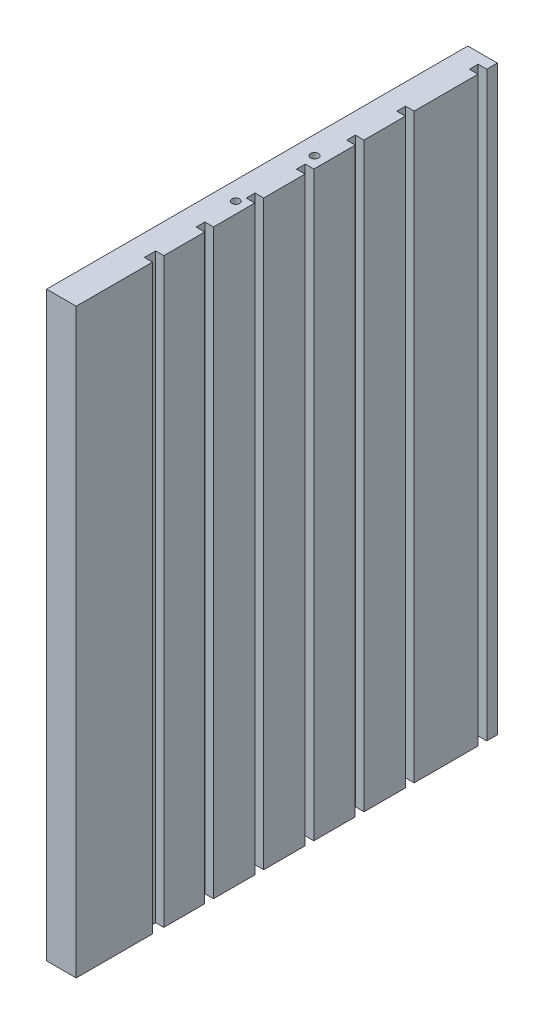
ISO-10303-21;
HEADER;
FILE_DESCRIPTION(('STEP AP214'),'2;1');
FILE_NAME('part.step','',(''),(''),'','','');
FILE_SCHEMA(('AUTOMOTIVE_DESIGN { 1 0 10303 214 1 1 1 1 }'));
ENDSEC;
DATA;
#1=APPLICATION_CONTEXT('core data for automotive mechanical design processes');
#2=APPLICATION_PROTOCOL_DEFINITION('international standard','automotive_design',2000,#1);
#3=PRODUCT_CONTEXT('',#1,'mechanical');
#4=PRODUCT('Part','Part','',(#3));
#5=PRODUCT_RELATED_PRODUCT_CATEGORY('part','',(#4));
#6=PRODUCT_DEFINITION_FORMATION('','',#4);
#7=PRODUCT_DEFINITION_CONTEXT('part definition',#1,'design');
#8=PRODUCT_DEFINITION('design','',#6,#7);
#9=PRODUCT_DEFINITION_SHAPE('','',#8);
#10=(LENGTH_UNIT() NAMED_UNIT(*) SI_UNIT(.MILLI.,.METRE.));
#11=(NAMED_UNIT(*) PLANE_ANGLE_UNIT() SI_UNIT($,.RADIAN.));
#12=(NAMED_UNIT(*) SI_UNIT($,.STERADIAN.) SOLID_ANGLE_UNIT());
#13=UNCERTAINTY_MEASURE_WITH_UNIT(LENGTH_MEASURE(1.E-05),#10,'distance_accuracy_value','');
#14=(GEOMETRIC_REPRESENTATION_CONTEXT(3) GLOBAL_UNCERTAINTY_ASSIGNED_CONTEXT((#13)) GLOBAL_UNIT_ASSIGNED_CONTEXT((#10,
#11,#12)) REPRESENTATION_CONTEXT('',''));
#15=CARTESIAN_POINT('',(0.,0.,0.));
#16=DIRECTION('',(0.,0.,1.));
#17=DIRECTION('',(1.,0.,0.));
#18=AXIS2_PLACEMENT_3D('',#15,#16,#17);
#19=CARTESIAN_POINT('',(109.3,58.5000000003788,8.56666666666666));
#20=DIRECTION('',(0.,1.,0.));
#21=DIRECTION('',(-1.,0.,0.));
#22=AXIS2_PLACEMENT_3D('',#19,#20,#21);
#23=CONICAL_SURFACE('',#22,0.839499999557179,1.02974425720102);
#24=CARTESIAN_POINT('',(109.3,57.99557750953,8.56666666675193));
#25=VERTEX_POINT('',#24);
#26=VERTEX_LOOP('',#25);
#27=FACE_BOUND('',#26,.T.);
#28=CARTESIAN_POINT('',(109.3,58.5000000000001,8.56666666666666));
#29=DIRECTION('',(0.,-1.,0.));
#30=DIRECTION('',(1.,0.,0.));
#31=AXIS2_PLACEMENT_3D('',#28,#29,#30);
#32=CIRCLE('',#31,0.8395);
#33=CARTESIAN_POINT('',(110.1395,58.5000000000001,8.56666666666666));
#34=VERTEX_POINT('',#33);
#35=EDGE_CURVE('E234',#34,#34,#32,.F.);
#36=ORIENTED_EDGE('',*,*,#35,.T.);
#37=EDGE_LOOP('',(#36));
#38=FACE_BOUND('',#37,.T.);
#39=ADVANCED_FACE('F17',(#27,#38),#23,.F.);
#40=CARTESIAN_POINT('',(109.3,58.5000000004356,-8.36666666666666));
#41=DIRECTION('',(0.,1.,0.));
#42=DIRECTION('',(-1.,0.,0.));
#43=AXIS2_PLACEMENT_3D('',#40,#41,#42);
#44=CONICAL_SURFACE('',#43,0.839499999550884,1.02974425714465);
#45=CARTESIAN_POINT('',(109.3,57.99557750953,-8.36666666658139));
#46=VERTEX_POINT('',#45);
#47=VERTEX_LOOP('',#46);
#48=FACE_BOUND('',#47,.T.);
#49=CARTESIAN_POINT('',(109.3,58.5000000000001,-8.36666666666666));
#50=DIRECTION('',(0.,-1.,0.));
#51=DIRECTION('',(1.,0.,0.));
#52=AXIS2_PLACEMENT_3D('',#49,#50,#51);
#53=CIRCLE('',#52,0.8395);
#54=CARTESIAN_POINT('',(110.1395,58.5000000000001,-8.36666666666666));
#55=VERTEX_POINT('',#54);
#56=EDGE_CURVE('E236',#55,#55,#53,.F.);
#57=ORIENTED_EDGE('',*,*,#56,.T.);
#58=EDGE_LOOP('',(#57));
#59=FACE_BOUND('',#58,.T.);
#60=ADVANCED_FACE('F231',(#48,#59),#44,.F.);
#61=CARTESIAN_POINT('',(111.700000000004,-62.4999999999998,-25.49));
#62=DIRECTION('',(0.,0.,1.));
#63=DIRECTION('',(1.,0.,0.));
#64=AXIS2_PLACEMENT_3D('',#61,#62,#63);
#65=PLANE('',#64);
#66=DIRECTION('',(0.,1.,0.));
#67=VECTOR('',#66,1.);
#68=CARTESIAN_POINT('',(111.7,62.5000000000002,-25.49));
#69=LINE('',#68,#67);
#70=CARTESIAN_POINT('',(111.700000000002,-62.4999999999998,-25.49));
#71=VERTEX_POINT('',#70);
#72=CARTESIAN_POINT('',(111.700000000002,62.5000000000002,-25.49));
#73=VERTEX_POINT('',#72);
#74=EDGE_CURVE('E243',#71,#73,#69,.T.);
#75=ORIENTED_EDGE('',*,*,#74,.F.);
#76=DIRECTION('',(1.,0.,0.));
#77=VECTOR('',#76,1.);
#78=CARTESIAN_POINT('',(109.700000000004,-62.4999999999999,-25.49));
#79=LINE('',#78,#77);
#80=CARTESIAN_POINT('',(109.850000000003,-62.4999999999999,-25.49));
#81=VERTEX_POINT('',#80);
#82=EDGE_CURVE('E356',#71,#81,#79,.F.);
#83=ORIENTED_EDGE('',*,*,#82,.T.);
#84=DIRECTION('',(0.,1.,0.));
#85=VECTOR('',#84,1.);
#86=CARTESIAN_POINT('',(109.850000000004,-62.4999999999999,-25.49));
#87=LINE('',#86,#85);
#88=CARTESIAN_POINT('',(109.850000000001,62.5000000000002,-25.49));
#89=VERTEX_POINT('',#88);
#90=EDGE_CURVE('E477',#81,#89,#87,.T.);
#91=ORIENTED_EDGE('',*,*,#90,.T.);
#92=DIRECTION('',(1.,0.,0.));
#93=VECTOR('',#92,1.);
#94=CARTESIAN_POINT('',(109.7,62.5000000000001,-25.49));
#95=LINE('',#94,#93);
#96=EDGE_CURVE('E350',#73,#89,#95,.F.);
#97=ORIENTED_EDGE('',*,*,#96,.F.);
#98=EDGE_LOOP('',(#75,#83,#91,#97));
#99=FACE_BOUND('',#98,.T.);
#100=ADVANCED_FACE('F480',(#99),#65,.F.);
#101=CARTESIAN_POINT('',(109.850000000004,-62.4999999999999,-25.49));
#102=DIRECTION('',(-1.,0.,0.));
#103=DIRECTION('',(0.,0.,1.));
#104=AXIS2_PLACEMENT_3D('',#101,#102,#103);
#105=PLANE('',#104);
#106=ORIENTED_EDGE('',*,*,#90,.F.);
#107=DIRECTION('',(0.,0.,1.));
#108=VECTOR('',#107,1.);
#109=CARTESIAN_POINT('',(109.850000000004,-62.4999999999999,0.));
#110=LINE('',#109,#108);
#111=CARTESIAN_POINT('',(109.850000000004,-62.4999999999999,-27.37));
#112=VERTEX_POINT('',#111);
#113=EDGE_CURVE('E416',#81,#112,#110,.F.);
#114=ORIENTED_EDGE('',*,*,#113,.T.);
#115=DIRECTION('',(0.,1.,0.));
#116=VECTOR('',#115,1.);
#117=CARTESIAN_POINT('',(109.850000000004,-62.4999999999999,-27.37));
#118=LINE('',#117,#116);
#119=CARTESIAN_POINT('',(109.850000000003,62.5000000000001,-27.37));
#120=VERTEX_POINT('',#119);
#121=EDGE_CURVE('E476',#112,#120,#118,.T.);
#122=ORIENTED_EDGE('',*,*,#121,.T.);
#123=DIRECTION('',(0.,0.,1.));
#124=VECTOR('',#123,1.);
#125=CARTESIAN_POINT('',(109.85,62.5000000000001,0.));
#126=LINE('',#125,#124);
#127=EDGE_CURVE('E347',#89,#120,#126,.F.);
#128=ORIENTED_EDGE('',*,*,#127,.F.);
#129=EDGE_LOOP('',(#106,#114,#122,#128));
#130=FACE_BOUND('',#129,.T.);
#131=ADVANCED_FACE('F484',(#130),#105,.F.);
#132=CARTESIAN_POINT('',(109.850000000004,-62.4999999999999,-27.37));
#133=DIRECTION('',(0.,0.,-1.));
#134=DIRECTION('',(-1.,0.,0.));
#135=AXIS2_PLACEMENT_3D('',#132,#133,#134);
#136=PLANE('',#135);
#137=ORIENTED_EDGE('',*,*,#121,.F.);
#138=DIRECTION('',(1.,0.,0.));
#139=VECTOR('',#138,1.);
#140=CARTESIAN_POINT('',(109.700000000004,-62.4999999999999,-27.37));
#141=LINE('',#140,#139);
#142=CARTESIAN_POINT('',(111.700000000001,-62.4999999999998,-27.37));
#143=VERTEX_POINT('',#142);
#144=EDGE_CURVE('E414',#112,#143,#141,.T.);
#145=ORIENTED_EDGE('',*,*,#144,.T.);
#146=DIRECTION('',(0.,1.,0.));
#147=VECTOR('',#146,1.);
#148=CARTESIAN_POINT('',(111.7,62.5000000000002,-27.37));
#149=LINE('',#148,#147);
#150=CARTESIAN_POINT('',(111.7,62.5000000000001,-27.37));
#151=VERTEX_POINT('',#150);
#152=EDGE_CURVE('E473',#151,#143,#149,.F.);
#153=ORIENTED_EDGE('',*,*,#152,.F.);
#154=DIRECTION('',(1.,0.,0.));
#155=VECTOR('',#154,1.);
#156=CARTESIAN_POINT('',(109.7,62.5000000000001,-27.37));
#157=LINE('',#156,#155);
#158=EDGE_CURVE('E344',#120,#151,#157,.T.);
#159=ORIENTED_EDGE('',*,*,#158,.F.);
#160=EDGE_LOOP('',(#137,#145,#153,#159));
#161=FACE_BOUND('',#160,.T.);
#162=ADVANCED_FACE('F621',(#161),#136,.F.);
#163=CARTESIAN_POINT('',(111.7,62.5000000000002,42.65));
#164=DIRECTION('',(1.,0.,0.));
#165=DIRECTION('',(0.,0.,-1.));
#166=AXIS2_PLACEMENT_3D('',#163,#164,#165);
#167=PLANE('',#166);
#168=DIRECTION('',(0.,1.,0.));
#169=VECTOR('',#168,1.);
#170=CARTESIAN_POINT('',(111.700000000004,-62.4999999999998,-41.09));
#171=LINE('',#170,#169);
#172=CARTESIAN_POINT('',(111.700000000002,-62.4999999999998,-41.09));
#173=VERTEX_POINT('',#172);
#174=CARTESIAN_POINT('',(111.700000000001,62.5000000000002,-41.09));
#175=VERTEX_POINT('',#174);
#176=EDGE_CURVE('E471',#173,#175,#171,.T.);
#177=ORIENTED_EDGE('',*,*,#176,.T.);
#178=DIRECTION('',(0.,0.,1.));
#179=VECTOR('',#178,1.);
#180=CARTESIAN_POINT('',(111.7,62.5000000000001,0.));
#181=LINE('',#180,#179);
#182=EDGE_CURVE('E341',#151,#175,#181,.F.);
#183=ORIENTED_EDGE('',*,*,#182,.F.);
#184=ORIENTED_EDGE('',*,*,#152,.T.);
#185=DIRECTION('',(0.,0.,1.));
#186=VECTOR('',#185,1.);
#187=CARTESIAN_POINT('',(111.700000000004,-62.4999999999999,0.));
#188=LINE('',#187,#186);
#189=EDGE_CURVE('E412',#143,#173,#188,.F.);
#190=ORIENTED_EDGE('',*,*,#189,.T.);
#191=EDGE_LOOP('',(#177,#183,#184,#190));
#192=FACE_BOUND('',#191,.T.);
#193=ADVANCED_FACE('F617',(#192),#167,.T.);
#194=CARTESIAN_POINT('',(111.700000000004,-62.4999999999998,-41.09));
#195=DIRECTION('',(0.,0.,1.));
#196=DIRECTION('',(1.,0.,0.));
#197=AXIS2_PLACEMENT_3D('',#194,#195,#196);
#198=PLANE('',#197);
#199=ORIENTED_EDGE('',*,*,#176,.F.);
#200=DIRECTION('',(1.,0.,0.));
#201=VECTOR('',#200,1.);
#202=CARTESIAN_POINT('',(109.700000000004,-62.4999999999999,-41.09));
#203=LINE('',#202,#201);
#204=CARTESIAN_POINT('',(109.850000000002,-62.4999999999999,-41.09));
#205=VERTEX_POINT('',#204);
#206=EDGE_CURVE('E410',#173,#205,#203,.F.);
#207=ORIENTED_EDGE('',*,*,#206,.T.);
#208=DIRECTION('',(0.,1.,0.));
#209=VECTOR('',#208,1.);
#210=CARTESIAN_POINT('',(109.850000000004,-62.4999999999999,-41.09));
#211=LINE('',#210,#209);
#212=CARTESIAN_POINT('',(109.850000000001,62.5000000000002,-41.09));
#213=VERTEX_POINT('',#212);
#214=EDGE_CURVE('E469',#205,#213,#211,.T.);
#215=ORIENTED_EDGE('',*,*,#214,.T.);
#216=DIRECTION('',(1.,0.,0.));
#217=VECTOR('',#216,1.);
#218=CARTESIAN_POINT('',(109.7,62.5000000000001,-41.09));
#219=LINE('',#218,#217);
#220=EDGE_CURVE('E338',#175,#213,#219,.F.);
#221=ORIENTED_EDGE('',*,*,#220,.F.);
#222=EDGE_LOOP('',(#199,#207,#215,#221));
#223=FACE_BOUND('',#222,.T.);
#224=ADVANCED_FACE('F613',(#223),#198,.F.);
#225=CARTESIAN_POINT('',(109.850000000004,-62.4999999999999,-41.09));
#226=DIRECTION('',(-1.,0.,0.));
#227=DIRECTION('',(0.,0.,1.));
#228=AXIS2_PLACEMENT_3D('',#225,#226,#227);
#229=PLANE('',#228);
#230=ORIENTED_EDGE('',*,*,#214,.F.);
#231=DIRECTION('',(0.,0.,1.));
#232=VECTOR('',#231,1.);
#233=CARTESIAN_POINT('',(109.850000000004,-62.4999999999999,0.));
#234=LINE('',#233,#232);
#235=CARTESIAN_POINT('',(109.850000000004,-62.4999999999999,-42.97));
#236=VERTEX_POINT('',#235);
#237=EDGE_CURVE('E408',#205,#236,#234,.F.);
#238=ORIENTED_EDGE('',*,*,#237,.T.);
#239=DIRECTION('',(0.,1.,0.));
#240=VECTOR('',#239,1.);
#241=CARTESIAN_POINT('',(109.850000000004,-62.4999999999999,-42.97));
#242=LINE('',#241,#240);
#243=CARTESIAN_POINT('',(109.850000000003,62.5000000000001,-42.97));
#244=VERTEX_POINT('',#243);
#245=EDGE_CURVE('E467',#236,#244,#242,.T.);
#246=ORIENTED_EDGE('',*,*,#245,.T.);
#247=DIRECTION('',(0.,0.,1.));
#248=VECTOR('',#247,1.);
#249=CARTESIAN_POINT('',(109.85,62.5000000000001,0.));
#250=LINE('',#249,#248);
#251=EDGE_CURVE('E335',#213,#244,#250,.F.);
#252=ORIENTED_EDGE('',*,*,#251,.F.);
#253=EDGE_LOOP('',(#230,#238,#246,#252));
#254=FACE_BOUND('',#253,.T.);
#255=ADVANCED_FACE('F609',(#254),#229,.F.);
#256=CARTESIAN_POINT('',(109.850000000004,-62.4999999999999,-42.97));
#257=DIRECTION('',(0.,0.,-1.));
#258=DIRECTION('',(-1.,0.,0.));
#259=AXIS2_PLACEMENT_3D('',#256,#257,#258);
#260=PLANE('',#259);
#261=ORIENTED_EDGE('',*,*,#245,.F.);
#262=DIRECTION('',(1.,0.,0.));
#263=VECTOR('',#262,1.);
#264=CARTESIAN_POINT('',(109.700000000004,-62.4999999999999,-42.97));
#265=LINE('',#264,#263);
#266=CARTESIAN_POINT('',(111.700000000001,-62.4999999999998,-42.97));
#267=VERTEX_POINT('',#266);
#268=EDGE_CURVE('E406',#236,#267,#265,.T.);
#269=ORIENTED_EDGE('',*,*,#268,.T.);
#270=DIRECTION('',(0.,1.,0.));
#271=VECTOR('',#270,1.);
#272=CARTESIAN_POINT('',(111.7,62.5000000000002,-42.97));
#273=LINE('',#272,#271);
#274=CARTESIAN_POINT('',(111.7,62.5000000000001,-42.97));
#275=VERTEX_POINT('',#274);
#276=EDGE_CURVE('E464',#275,#267,#273,.F.);
#277=ORIENTED_EDGE('',*,*,#276,.F.);
#278=DIRECTION('',(1.,0.,0.));
#279=VECTOR('',#278,1.);
#280=CARTESIAN_POINT('',(109.7,62.5000000000001,-42.97));
#281=LINE('',#280,#279);
#282=EDGE_CURVE('E332',#244,#275,#281,.T.);
#283=ORIENTED_EDGE('',*,*,#282,.F.);
#284=EDGE_LOOP('',(#261,#269,#277,#283));
#285=FACE_BOUND('',#284,.T.);
#286=ADVANCED_FACE('F605',(#285),#260,.F.);
#287=CARTESIAN_POINT('',(111.7,62.5000000000002,42.65));
#288=DIRECTION('',(1.,0.,0.));
#289=DIRECTION('',(0.,0.,-1.));
#290=AXIS2_PLACEMENT_3D('',#287,#288,#289);
#291=PLANE('',#290);
#292=DIRECTION('',(0.,1.,0.));
#293=VECTOR('',#292,1.);
#294=CARTESIAN_POINT('',(111.7,1.135082E-13,-45.24));
#295=LINE('',#294,#293);
#296=CARTESIAN_POINT('',(111.7,62.5000000000001,-45.24));
#297=VERTEX_POINT('',#296);
#298=CARTESIAN_POINT('',(111.700000000001,-62.4999999999998,-45.24));
#299=VERTEX_POINT('',#298);
#300=EDGE_CURVE('E240',#297,#299,#295,.F.);
#301=ORIENTED_EDGE('',*,*,#300,.F.);
#302=DIRECTION('',(0.,0.,1.));
#303=VECTOR('',#302,1.);
#304=CARTESIAN_POINT('',(111.7,62.5000000000001,0.));
#305=LINE('',#304,#303);
#306=EDGE_CURVE('E329',#275,#297,#305,.F.);
#307=ORIENTED_EDGE('',*,*,#306,.F.);
#308=ORIENTED_EDGE('',*,*,#276,.T.);
#309=DIRECTION('',(0.,0.,1.));
#310=VECTOR('',#309,1.);
#311=CARTESIAN_POINT('',(111.700000000004,-62.4999999999999,0.));
#312=LINE('',#311,#310);
#313=EDGE_CURVE('E404',#267,#299,#312,.F.);
#314=ORIENTED_EDGE('',*,*,#313,.T.);
#315=EDGE_LOOP('',(#301,#307,#308,#314));
#316=FACE_BOUND('',#315,.T.);
#317=ADVANCED_FACE('F601',(#316),#291,.T.);
#318=CARTESIAN_POINT('',(111.7,62.5000000000002,42.65));
#319=DIRECTION('',(1.,0.,0.));
#320=DIRECTION('',(0.,0.,-1.));
#321=AXIS2_PLACEMENT_3D('',#318,#319,#320);
#322=PLANE('',#321);
#323=DIRECTION('',(0.,1.,0.));
#324=VECTOR('',#323,1.);
#325=CARTESIAN_POINT('',(111.7,1.141744E-13,45.24));
#326=LINE('',#325,#324);
#327=CARTESIAN_POINT('',(111.7,62.5000000000001,45.24));
#328=VERTEX_POINT('',#327);
#329=CARTESIAN_POINT('',(111.700000000001,-62.4999999999998,45.24));
#330=VERTEX_POINT('',#329);
#331=EDGE_CURVE('E354',#328,#330,#326,.F.);
#332=ORIENTED_EDGE('',*,*,#331,.T.);
#333=DIRECTION('',(0.,0.,1.));
#334=VECTOR('',#333,1.);
#335=CARTESIAN_POINT('',(111.700000000004,-62.4999999999999,0.));
#336=LINE('',#335,#334);
#337=CARTESIAN_POINT('',(111.700000000002,-62.4999999999998,28.837));
#338=VERTEX_POINT('',#337);
#339=EDGE_CURVE('E400',#330,#338,#336,.F.);
#340=ORIENTED_EDGE('',*,*,#339,.T.);
#341=DIRECTION('',(0.,1.,0.));
#342=VECTOR('',#341,1.);
#343=CARTESIAN_POINT('',(111.700000000004,-62.4999999999998,28.837));
#344=LINE('',#343,#342);
#345=CARTESIAN_POINT('',(111.700000000001,62.5000000000002,28.837));
#346=VERTEX_POINT('',#345);
#347=EDGE_CURVE('E462',#338,#346,#344,.T.);
#348=ORIENTED_EDGE('',*,*,#347,.T.);
#349=DIRECTION('',(0.,0.,1.));
#350=VECTOR('',#349,1.);
#351=CARTESIAN_POINT('',(111.7,62.5000000000001,0.));
#352=LINE('',#351,#350);
#353=EDGE_CURVE('E322',#328,#346,#352,.F.);
#354=ORIENTED_EDGE('',*,*,#353,.F.);
#355=EDGE_LOOP('',(#332,#340,#348,#354));
#356=FACE_BOUND('',#355,.T.);
#357=ADVANCED_FACE('F597',(#356),#322,.T.);
#358=CARTESIAN_POINT('',(111.700000000004,-62.4999999999998,28.837));
#359=DIRECTION('',(0.,0.,1.));
#360=DIRECTION('',(1.,0.,0.));
#361=AXIS2_PLACEMENT_3D('',#358,#359,#360);
#362=PLANE('',#361);
#363=ORIENTED_EDGE('',*,*,#347,.F.);
#364=DIRECTION('',(1.,0.,0.));
#365=VECTOR('',#364,1.);
#366=CARTESIAN_POINT('',(109.700000000004,-62.4999999999999,28.837));
#367=LINE('',#366,#365);
#368=CARTESIAN_POINT('',(109.950000000002,-62.4999999999999,28.837));
#369=VERTEX_POINT('',#368);
#370=EDGE_CURVE('E398',#338,#369,#367,.F.);
#371=ORIENTED_EDGE('',*,*,#370,.T.);
#372=DIRECTION('',(0.,1.,0.));
#373=VECTOR('',#372,1.);
#374=CARTESIAN_POINT('',(109.950000000004,-62.4999999999999,28.837));
#375=LINE('',#374,#373);
#376=CARTESIAN_POINT('',(109.950000000001,62.5000000000002,28.837));
#377=VERTEX_POINT('',#376);
#378=EDGE_CURVE('E460',#369,#377,#375,.T.);
#379=ORIENTED_EDGE('',*,*,#378,.T.);
#380=DIRECTION('',(1.,0.,0.));
#381=VECTOR('',#380,1.);
#382=CARTESIAN_POINT('',(109.7,62.5000000000001,28.837));
#383=LINE('',#382,#381);
#384=EDGE_CURVE('E319',#346,#377,#383,.F.);
#385=ORIENTED_EDGE('',*,*,#384,.F.);
#386=EDGE_LOOP('',(#363,#371,#379,#385));
#387=FACE_BOUND('',#386,.T.);
#388=ADVANCED_FACE('F593',(#387),#362,.F.);
#389=CARTESIAN_POINT('',(109.950000000004,-62.4999999999999,28.837));
#390=DIRECTION('',(-1.,0.,0.));
#391=DIRECTION('',(0.,0.,1.));
#392=AXIS2_PLACEMENT_3D('',#389,#390,#391);
#393=PLANE('',#392);
#394=ORIENTED_EDGE('',*,*,#378,.F.);
#395=DIRECTION('',(0.,0.,1.));
#396=VECTOR('',#395,1.);
#397=CARTESIAN_POINT('',(109.950000000004,-62.4999999999999,0.));
#398=LINE('',#397,#396);
#399=CARTESIAN_POINT('',(109.950000000004,-62.4999999999999,26.423));
#400=VERTEX_POINT('',#399);
#401=EDGE_CURVE('E396',#369,#400,#398,.F.);
#402=ORIENTED_EDGE('',*,*,#401,.T.);
#403=DIRECTION('',(0.,1.,0.));
#404=VECTOR('',#403,1.);
#405=CARTESIAN_POINT('',(109.950000000004,-62.4999999999999,26.423));
#406=LINE('',#405,#404);
#407=CARTESIAN_POINT('',(109.950000000003,62.5000000000001,26.423));
#408=VERTEX_POINT('',#407);
#409=EDGE_CURVE('E458',#400,#408,#406,.T.);
#410=ORIENTED_EDGE('',*,*,#409,.T.);
#411=DIRECTION('',(0.,0.,1.));
#412=VECTOR('',#411,1.);
#413=CARTESIAN_POINT('',(109.95,62.5000000000001,0.));
#414=LINE('',#413,#412);
#415=EDGE_CURVE('E316',#377,#408,#414,.F.);
#416=ORIENTED_EDGE('',*,*,#415,.F.);
#417=EDGE_LOOP('',(#394,#402,#410,#416));
#418=FACE_BOUND('',#417,.T.);
#419=ADVANCED_FACE('F589',(#418),#393,.F.);
#420=CARTESIAN_POINT('',(109.950000000004,-62.4999999999999,26.423));
#421=DIRECTION('',(0.,0.,-1.));
#422=DIRECTION('',(-1.,0.,0.));
#423=AXIS2_PLACEMENT_3D('',#420,#421,#422);
#424=PLANE('',#423);
#425=ORIENTED_EDGE('',*,*,#409,.F.);
#426=DIRECTION('',(1.,0.,0.));
#427=VECTOR('',#426,1.);
#428=CARTESIAN_POINT('',(109.700000000004,-62.4999999999999,26.423));
#429=LINE('',#428,#427);
#430=CARTESIAN_POINT('',(111.700000000001,-62.4999999999998,26.423));
#431=VERTEX_POINT('',#430);
#432=EDGE_CURVE('E394',#400,#431,#429,.T.);
#433=ORIENTED_EDGE('',*,*,#432,.T.);
#434=DIRECTION('',(0.,1.,0.));
#435=VECTOR('',#434,1.);
#436=CARTESIAN_POINT('',(111.7,62.5000000000002,26.423));
#437=LINE('',#436,#435);
#438=CARTESIAN_POINT('',(111.7,62.5000000000001,26.423));
#439=VERTEX_POINT('',#438);
#440=EDGE_CURVE('E455',#439,#431,#437,.F.);
#441=ORIENTED_EDGE('',*,*,#440,.F.);
#442=DIRECTION('',(1.,0.,0.));
#443=VECTOR('',#442,1.);
#444=CARTESIAN_POINT('',(109.7,62.5000000000001,26.423));
#445=LINE('',#444,#443);
#446=EDGE_CURVE('E313',#408,#439,#445,.T.);
#447=ORIENTED_EDGE('',*,*,#446,.F.);
#448=EDGE_LOOP('',(#425,#433,#441,#447));
#449=FACE_BOUND('',#448,.T.);
#450=ADVANCED_FACE('F585',(#449),#424,.F.);
#451=CARTESIAN_POINT('',(111.7,62.5000000000002,42.65));
#452=DIRECTION('',(1.,0.,0.));
#453=DIRECTION('',(0.,0.,-1.));
#454=AXIS2_PLACEMENT_3D('',#451,#452,#453);
#455=PLANE('',#454);
#456=ORIENTED_EDGE('',*,*,#440,.T.);
#457=DIRECTION('',(0.,0.,1.));
#458=VECTOR('',#457,1.);
#459=CARTESIAN_POINT('',(111.700000000004,-62.4999999999999,0.));
#460=LINE('',#459,#458);
#461=CARTESIAN_POINT('',(111.700000000002,-62.4999999999998,17.63));
#462=VERTEX_POINT('',#461);
#463=EDGE_CURVE('E392',#431,#462,#460,.F.);
#464=ORIENTED_EDGE('',*,*,#463,.T.);
#465=DIRECTION('',(0.,1.,0.));
#466=VECTOR('',#465,1.);
#467=CARTESIAN_POINT('',(111.700000000004,-62.4999999999998,17.63));
#468=LINE('',#467,#466);
#469=CARTESIAN_POINT('',(111.700000000001,62.5000000000002,17.63));
#470=VERTEX_POINT('',#469);
#471=EDGE_CURVE('E453',#462,#470,#468,.T.);
#472=ORIENTED_EDGE('',*,*,#471,.T.);
#473=DIRECTION('',(0.,0.,1.));
#474=VECTOR('',#473,1.);
#475=CARTESIAN_POINT('',(111.7,62.5000000000001,0.));
#476=LINE('',#475,#474);
#477=EDGE_CURVE('E310',#439,#470,#476,.F.);
#478=ORIENTED_EDGE('',*,*,#477,.F.);
#479=EDGE_LOOP('',(#456,#464,#472,#478));
#480=FACE_BOUND('',#479,.T.);
#481=ADVANCED_FACE('F581',(#480),#455,.T.);
#482=CARTESIAN_POINT('',(111.700000000004,-62.4999999999998,17.63));
#483=DIRECTION('',(0.,0.,1.));
#484=DIRECTION('',(1.,0.,0.));
#485=AXIS2_PLACEMENT_3D('',#482,#483,#484);
#486=PLANE('',#485);
#487=ORIENTED_EDGE('',*,*,#471,.F.);
#488=DIRECTION('',(1.,0.,0.));
#489=VECTOR('',#488,1.);
#490=CARTESIAN_POINT('',(109.700000000004,-62.4999999999999,17.63));
#491=LINE('',#490,#489);
#492=CARTESIAN_POINT('',(109.850000000002,-62.4999999999999,17.63));
#493=VERTEX_POINT('',#492);
#494=EDGE_CURVE('E390',#462,#493,#491,.F.);
#495=ORIENTED_EDGE('',*,*,#494,.T.);
#496=DIRECTION('',(0.,1.,0.));
#497=VECTOR('',#496,1.);
#498=CARTESIAN_POINT('',(109.850000000004,-62.4999999999999,17.63));
#499=LINE('',#498,#497);
#500=CARTESIAN_POINT('',(109.850000000001,62.5000000000002,17.63));
#501=VERTEX_POINT('',#500);
#502=EDGE_CURVE('E451',#493,#501,#499,.T.);
#503=ORIENTED_EDGE('',*,*,#502,.T.);
#504=DIRECTION('',(1.,0.,0.));
#505=VECTOR('',#504,1.);
#506=CARTESIAN_POINT('',(109.7,62.5000000000001,17.63));
#507=LINE('',#506,#505);
#508=EDGE_CURVE('E307',#470,#501,#507,.F.);
#509=ORIENTED_EDGE('',*,*,#508,.F.);
#510=EDGE_LOOP('',(#487,#495,#503,#509));
#511=FACE_BOUND('',#510,.T.);
#512=ADVANCED_FACE('F577',(#511),#486,.F.);
#513=CARTESIAN_POINT('',(109.850000000004,-62.4999999999999,17.63));
#514=DIRECTION('',(-1.,0.,0.));
#515=DIRECTION('',(0.,0.,1.));
#516=AXIS2_PLACEMENT_3D('',#513,#514,#515);
#517=PLANE('',#516);
#518=ORIENTED_EDGE('',*,*,#502,.F.);
#519=DIRECTION('',(0.,0.,1.));
#520=VECTOR('',#519,1.);
#521=CARTESIAN_POINT('',(109.850000000004,-62.4999999999999,0.));
#522=LINE('',#521,#520);
#523=CARTESIAN_POINT('',(109.850000000004,-62.4999999999999,15.75));
#524=VERTEX_POINT('',#523);
#525=EDGE_CURVE('E388',#493,#524,#522,.F.);
#526=ORIENTED_EDGE('',*,*,#525,.T.);
#527=DIRECTION('',(0.,1.,0.));
#528=VECTOR('',#527,1.);
#529=CARTESIAN_POINT('',(109.850000000004,-62.4999999999999,15.75));
#530=LINE('',#529,#528);
#531=CARTESIAN_POINT('',(109.850000000003,62.5000000000001,15.75));
#532=VERTEX_POINT('',#531);
#533=EDGE_CURVE('E449',#524,#532,#530,.T.);
#534=ORIENTED_EDGE('',*,*,#533,.T.);
#535=DIRECTION('',(0.,0.,1.));
#536=VECTOR('',#535,1.);
#537=CARTESIAN_POINT('',(109.85,62.5000000000001,0.));
#538=LINE('',#537,#536);
#539=EDGE_CURVE('E304',#501,#532,#538,.F.);
#540=ORIENTED_EDGE('',*,*,#539,.F.);
#541=EDGE_LOOP('',(#518,#526,#534,#540));
#542=FACE_BOUND('',#541,.T.);
#543=ADVANCED_FACE('F573',(#542),#517,.F.);
#544=CARTESIAN_POINT('',(109.850000000004,-62.4999999999999,15.75));
#545=DIRECTION('',(0.,0.,-1.));
#546=DIRECTION('',(-1.,0.,0.));
#547=AXIS2_PLACEMENT_3D('',#544,#545,#546);
#548=PLANE('',#547);
#549=ORIENTED_EDGE('',*,*,#533,.F.);
#550=DIRECTION('',(1.,0.,0.));
#551=VECTOR('',#550,1.);
#552=CARTESIAN_POINT('',(109.700000000004,-62.4999999999999,15.75));
#553=LINE('',#552,#551);
#554=CARTESIAN_POINT('',(111.700000000001,-62.4999999999998,15.75));
#555=VERTEX_POINT('',#554);
#556=EDGE_CURVE('E386',#524,#555,#553,.T.);
#557=ORIENTED_EDGE('',*,*,#556,.T.);
#558=DIRECTION('',(0.,1.,0.));
#559=VECTOR('',#558,1.);
#560=CARTESIAN_POINT('',(111.7,62.5000000000002,15.75));
#561=LINE('',#560,#559);
#562=CARTESIAN_POINT('',(111.7,62.5000000000001,15.75));
#563=VERTEX_POINT('',#562);
#564=EDGE_CURVE('E446',#563,#555,#561,.F.);
#565=ORIENTED_EDGE('',*,*,#564,.F.);
#566=DIRECTION('',(1.,0.,0.));
#567=VECTOR('',#566,1.);
#568=CARTESIAN_POINT('',(109.7,62.5000000000001,15.75));
#569=LINE('',#568,#567);
#570=EDGE_CURVE('E301',#532,#563,#569,.T.);
#571=ORIENTED_EDGE('',*,*,#570,.F.);
#572=EDGE_LOOP('',(#549,#557,#565,#571));
#573=FACE_BOUND('',#572,.T.);
#574=ADVANCED_FACE('F569',(#573),#548,.F.);
#575=CARTESIAN_POINT('',(111.7,62.5000000000002,42.65));
#576=DIRECTION('',(1.,0.,0.));
#577=DIRECTION('',(0.,0.,-1.));
#578=AXIS2_PLACEMENT_3D('',#575,#576,#577);
#579=PLANE('',#578);
#580=DIRECTION('',(0.,1.,0.));
#581=VECTOR('',#580,1.);
#582=CARTESIAN_POINT('',(111.700000000004,-62.4999999999998,6.84999999999998));
#583=LINE('',#582,#581);
#584=CARTESIAN_POINT('',(111.700000000002,-62.4999999999998,6.84999999999998));
#585=VERTEX_POINT('',#584);
#586=CARTESIAN_POINT('',(111.700000000001,62.5000000000002,6.84999999999998));
#587=VERTEX_POINT('',#586);
#588=EDGE_CURVE('E444',#585,#587,#583,.T.);
#589=ORIENTED_EDGE('',*,*,#588,.T.);
#590=DIRECTION('',(0.,0.,1.));
#591=VECTOR('',#590,1.);
#592=CARTESIAN_POINT('',(111.7,62.5000000000001,0.));
#593=LINE('',#592,#591);
#594=EDGE_CURVE('E298',#563,#587,#593,.F.);
#595=ORIENTED_EDGE('',*,*,#594,.F.);
#596=ORIENTED_EDGE('',*,*,#564,.T.);
#597=DIRECTION('',(0.,0.,1.));
#598=VECTOR('',#597,1.);
#599=CARTESIAN_POINT('',(111.700000000004,-62.4999999999999,0.));
#600=LINE('',#599,#598);
#601=EDGE_CURVE('E384',#555,#585,#600,.F.);
#602=ORIENTED_EDGE('',*,*,#601,.T.);
#603=EDGE_LOOP('',(#589,#595,#596,#602));
#604=FACE_BOUND('',#603,.T.);
#605=ADVANCED_FACE('F565',(#604),#579,.T.);
#606=CARTESIAN_POINT('',(111.700000000004,-62.4999999999998,6.84999999999998));
#607=DIRECTION('',(0.,0.,1.));
#608=DIRECTION('',(1.,0.,0.));
#609=AXIS2_PLACEMENT_3D('',#606,#607,#608);
#610=PLANE('',#609);
#611=ORIENTED_EDGE('',*,*,#588,.F.);
#612=DIRECTION('',(1.,0.,0.));
#613=VECTOR('',#612,1.);
#614=CARTESIAN_POINT('',(109.700000000004,-62.4999999999999,6.84999999999998));
#615=LINE('',#614,#613);
#616=CARTESIAN_POINT('',(109.850000000002,-62.4999999999999,6.84999999999998));
#617=VERTEX_POINT('',#616);
#618=EDGE_CURVE('E382',#585,#617,#615,.F.);
#619=ORIENTED_EDGE('',*,*,#618,.T.);
#620=DIRECTION('',(0.,1.,0.));
#621=VECTOR('',#620,1.);
#622=CARTESIAN_POINT('',(109.850000000004,-62.4999999999999,6.84999999999998));
#623=LINE('',#622,#621);
#624=CARTESIAN_POINT('',(109.850000000001,62.5000000000002,6.84999999999998));
#625=VERTEX_POINT('',#624);
#626=EDGE_CURVE('E442',#617,#625,#623,.T.);
#627=ORIENTED_EDGE('',*,*,#626,.T.);
#628=DIRECTION('',(1.,0.,0.));
#629=VECTOR('',#628,1.);
#630=CARTESIAN_POINT('',(109.7,62.5000000000001,6.84999999999997));
#631=LINE('',#630,#629);
#632=EDGE_CURVE('E295',#587,#625,#631,.F.);
#633=ORIENTED_EDGE('',*,*,#632,.F.);
#634=EDGE_LOOP('',(#611,#619,#627,#633));
#635=FACE_BOUND('',#634,.T.);
#636=ADVANCED_FACE('F561',(#635),#610,.F.);
#637=CARTESIAN_POINT('',(109.850000000004,-62.4999999999999,6.84999999999998));
#638=DIRECTION('',(-1.,0.,0.));
#639=DIRECTION('',(0.,0.,1.));
#640=AXIS2_PLACEMENT_3D('',#637,#638,#639);
#641=PLANE('',#640);
#642=ORIENTED_EDGE('',*,*,#626,.F.);
#643=DIRECTION('',(0.,0.,1.));
#644=VECTOR('',#643,1.);
#645=CARTESIAN_POINT('',(109.850000000004,-62.4999999999999,0.));
#646=LINE('',#645,#644);
#647=CARTESIAN_POINT('',(109.850000000004,-62.4999999999999,4.96999999999998));
#648=VERTEX_POINT('',#647);
#649=EDGE_CURVE('E380',#617,#648,#646,.F.);
#650=ORIENTED_EDGE('',*,*,#649,.T.);
#651=DIRECTION('',(0.,1.,0.));
#652=VECTOR('',#651,1.);
#653=CARTESIAN_POINT('',(109.850000000004,-62.4999999999999,4.96999999999999));
#654=LINE('',#653,#652);
#655=CARTESIAN_POINT('',(109.850000000003,62.5000000000001,4.96999999999998));
#656=VERTEX_POINT('',#655);
#657=EDGE_CURVE('E440',#648,#656,#654,.T.);
#658=ORIENTED_EDGE('',*,*,#657,.T.);
#659=DIRECTION('',(0.,0.,1.));
#660=VECTOR('',#659,1.);
#661=CARTESIAN_POINT('',(109.85,62.5000000000001,0.));
#662=LINE('',#661,#660);
#663=EDGE_CURVE('E292',#625,#656,#662,.F.);
#664=ORIENTED_EDGE('',*,*,#663,.F.);
#665=EDGE_LOOP('',(#642,#650,#658,#664));
#666=FACE_BOUND('',#665,.T.);
#667=ADVANCED_FACE('F557',(#666),#641,.F.);
#668=CARTESIAN_POINT('',(109.850000000004,-62.4999999999999,4.96999999999999));
#669=DIRECTION('',(0.,0.,-1.));
#670=DIRECTION('',(-1.,0.,0.));
#671=AXIS2_PLACEMENT_3D('',#668,#669,#670);
#672=PLANE('',#671);
#673=ORIENTED_EDGE('',*,*,#657,.F.);
#674=DIRECTION('',(1.,0.,0.));
#675=VECTOR('',#674,1.);
#676=CARTESIAN_POINT('',(109.700000000004,-62.4999999999999,4.96999999999999));
#677=LINE('',#676,#675);
#678=CARTESIAN_POINT('',(111.700000000001,-62.4999999999998,4.96999999999999));
#679=VERTEX_POINT('',#678);
#680=EDGE_CURVE('E378',#648,#679,#677,.T.);
#681=ORIENTED_EDGE('',*,*,#680,.T.);
#682=DIRECTION('',(0.,1.,0.));
#683=VECTOR('',#682,1.);
#684=CARTESIAN_POINT('',(111.7,62.5000000000002,4.96999999999998));
#685=LINE('',#684,#683);
#686=CARTESIAN_POINT('',(111.7,62.5000000000001,4.96999999999998));
#687=VERTEX_POINT('',#686);
#688=EDGE_CURVE('E437',#687,#679,#685,.F.);
#689=ORIENTED_EDGE('',*,*,#688,.F.);
#690=DIRECTION('',(1.,0.,0.));
#691=VECTOR('',#690,1.);
#692=CARTESIAN_POINT('',(109.7,62.5000000000001,4.96999999999998));
#693=LINE('',#692,#691);
#694=EDGE_CURVE('E289',#656,#687,#693,.T.);
#695=ORIENTED_EDGE('',*,*,#694,.F.);
#696=EDGE_LOOP('',(#673,#681,#689,#695));
#697=FACE_BOUND('',#696,.T.);
#698=ADVANCED_FACE('F553',(#697),#672,.F.);
#699=CARTESIAN_POINT('',(111.7,62.5000000000002,42.65));
#700=DIRECTION('',(1.,0.,0.));
#701=DIRECTION('',(0.,0.,-1.));
#702=AXIS2_PLACEMENT_3D('',#699,#700,#701);
#703=PLANE('',#702);
#704=ORIENTED_EDGE('',*,*,#688,.T.);
#705=DIRECTION('',(0.,0.,1.));
#706=VECTOR('',#705,1.);
#707=CARTESIAN_POINT('',(111.700000000004,-62.4999999999999,0.));
#708=LINE('',#707,#706);
#709=CARTESIAN_POINT('',(111.700000000002,-62.4999999999998,-3.93000000000002));
#710=VERTEX_POINT('',#709);
#711=EDGE_CURVE('E376',#679,#710,#708,.F.);
#712=ORIENTED_EDGE('',*,*,#711,.T.);
#713=DIRECTION('',(0.,1.,0.));
#714=VECTOR('',#713,1.);
#715=CARTESIAN_POINT('',(111.700000000004,-62.4999999999998,-3.93000000000002));
#716=LINE('',#715,#714);
#717=CARTESIAN_POINT('',(111.700000000001,62.5000000000002,-3.93000000000002));
#718=VERTEX_POINT('',#717);
#719=EDGE_CURVE('E435',#710,#718,#716,.T.);
#720=ORIENTED_EDGE('',*,*,#719,.T.);
#721=DIRECTION('',(0.,0.,1.));
#722=VECTOR('',#721,1.);
#723=CARTESIAN_POINT('',(111.7,62.5000000000001,0.));
#724=LINE('',#723,#722);
#725=EDGE_CURVE('E286',#687,#718,#724,.F.);
#726=ORIENTED_EDGE('',*,*,#725,.F.);
#727=EDGE_LOOP('',(#704,#712,#720,#726));
#728=FACE_BOUND('',#727,.T.);
#729=ADVANCED_FACE('F549',(#728),#703,.T.);
#730=CARTESIAN_POINT('',(111.700000000004,-62.4999999999998,-3.93000000000002));
#731=DIRECTION('',(0.,0.,1.));
#732=DIRECTION('',(1.,0.,0.));
#733=AXIS2_PLACEMENT_3D('',#730,#731,#732);
#734=PLANE('',#733);
#735=ORIENTED_EDGE('',*,*,#719,.F.);
#736=DIRECTION('',(1.,0.,0.));
#737=VECTOR('',#736,1.);
#738=CARTESIAN_POINT('',(109.700000000004,-62.4999999999999,-3.93000000000002));
#739=LINE('',#738,#737);
#740=CARTESIAN_POINT('',(109.850000000002,-62.4999999999999,-3.93000000000002));
#741=VERTEX_POINT('',#740);
#742=EDGE_CURVE('E374',#710,#741,#739,.F.);
#743=ORIENTED_EDGE('',*,*,#742,.T.);
#744=DIRECTION('',(0.,1.,0.));
#745=VECTOR('',#744,1.);
#746=CARTESIAN_POINT('',(109.850000000004,-62.4999999999999,-3.93000000000002));
#747=LINE('',#746,#745);
#748=CARTESIAN_POINT('',(109.850000000001,62.5000000000002,-3.93000000000002));
#749=VERTEX_POINT('',#748);
#750=EDGE_CURVE('E433',#741,#749,#747,.T.);
#751=ORIENTED_EDGE('',*,*,#750,.T.);
#752=DIRECTION('',(1.,0.,0.));
#753=VECTOR('',#752,1.);
#754=CARTESIAN_POINT('',(109.7,62.5000000000001,-3.93000000000003));
#755=LINE('',#754,#753);
#756=EDGE_CURVE('E283',#718,#749,#755,.F.);
#757=ORIENTED_EDGE('',*,*,#756,.F.);
#758=EDGE_LOOP('',(#735,#743,#751,#757));
#759=FACE_BOUND('',#758,.T.);
#760=ADVANCED_FACE('F545',(#759),#734,.F.);
#761=CARTESIAN_POINT('',(109.850000000004,-62.4999999999999,-3.93000000000002));
#762=DIRECTION('',(-1.,0.,0.));
#763=DIRECTION('',(0.,0.,1.));
#764=AXIS2_PLACEMENT_3D('',#761,#762,#763);
#765=PLANE('',#764);
#766=ORIENTED_EDGE('',*,*,#750,.F.);
#767=DIRECTION('',(0.,0.,1.));
#768=VECTOR('',#767,1.);
#769=CARTESIAN_POINT('',(109.850000000004,-62.4999999999999,0.));
#770=LINE('',#769,#768);
#771=CARTESIAN_POINT('',(109.850000000004,-62.4999999999999,-5.81000000000002));
#772=VERTEX_POINT('',#771);
#773=EDGE_CURVE('E372',#741,#772,#770,.F.);
#774=ORIENTED_EDGE('',*,*,#773,.T.);
#775=DIRECTION('',(0.,1.,0.));
#776=VECTOR('',#775,1.);
#777=CARTESIAN_POINT('',(109.850000000004,-62.4999999999999,-5.81000000000001));
#778=LINE('',#777,#776);
#779=CARTESIAN_POINT('',(109.850000000003,62.5000000000001,-5.81000000000002));
#780=VERTEX_POINT('',#779);
#781=EDGE_CURVE('E431',#772,#780,#778,.T.);
#782=ORIENTED_EDGE('',*,*,#781,.T.);
#783=DIRECTION('',(0.,0.,1.));
#784=VECTOR('',#783,1.);
#785=CARTESIAN_POINT('',(109.85,62.5000000000001,0.));
#786=LINE('',#785,#784);
#787=EDGE_CURVE('E280',#749,#780,#786,.F.);
#788=ORIENTED_EDGE('',*,*,#787,.F.);
#789=EDGE_LOOP('',(#766,#774,#782,#788));
#790=FACE_BOUND('',#789,.T.);
#791=ADVANCED_FACE('F541',(#790),#765,.F.);
#792=CARTESIAN_POINT('',(109.850000000004,-62.4999999999999,-5.81000000000001));
#793=DIRECTION('',(0.,0.,-1.));
#794=DIRECTION('',(-1.,0.,0.));
#795=AXIS2_PLACEMENT_3D('',#792,#793,#794);
#796=PLANE('',#795);
#797=ORIENTED_EDGE('',*,*,#781,.F.);
#798=DIRECTION('',(1.,0.,0.));
#799=VECTOR('',#798,1.);
#800=CARTESIAN_POINT('',(109.700000000004,-62.4999999999999,-5.81000000000001));
#801=LINE('',#800,#799);
#802=CARTESIAN_POINT('',(111.700000000001,-62.4999999999998,-5.81000000000002));
#803=VERTEX_POINT('',#802);
#804=EDGE_CURVE('E370',#772,#803,#801,.T.);
#805=ORIENTED_EDGE('',*,*,#804,.T.);
#806=DIRECTION('',(0.,1.,0.));
#807=VECTOR('',#806,1.);
#808=CARTESIAN_POINT('',(111.7,62.5000000000002,-5.81000000000002));
#809=LINE('',#808,#807);
#810=CARTESIAN_POINT('',(111.7,62.5000000000001,-5.81000000000002));
#811=VERTEX_POINT('',#810);
#812=EDGE_CURVE('E428',#811,#803,#809,.F.);
#813=ORIENTED_EDGE('',*,*,#812,.F.);
#814=DIRECTION('',(1.,0.,0.));
#815=VECTOR('',#814,1.);
#816=CARTESIAN_POINT('',(109.7,62.5000000000001,-5.81000000000002));
#817=LINE('',#816,#815);
#818=EDGE_CURVE('E277',#780,#811,#817,.T.);
#819=ORIENTED_EDGE('',*,*,#818,.F.);
#820=EDGE_LOOP('',(#797,#805,#813,#819));
#821=FACE_BOUND('',#820,.T.);
#822=ADVANCED_FACE('F537',(#821),#796,.F.);
#823=CARTESIAN_POINT('',(111.7,62.5000000000002,42.65));
#824=DIRECTION('',(1.,0.,0.));
#825=DIRECTION('',(0.,0.,-1.));
#826=AXIS2_PLACEMENT_3D('',#823,#824,#825);
#827=PLANE('',#826);
#828=DIRECTION('',(0.,1.,0.));
#829=VECTOR('',#828,1.);
#830=CARTESIAN_POINT('',(111.700000000004,-62.4999999999998,-14.71));
#831=LINE('',#830,#829);
#832=CARTESIAN_POINT('',(111.700000000002,-62.4999999999998,-14.71));
#833=VERTEX_POINT('',#832);
#834=CARTESIAN_POINT('',(111.700000000001,62.5000000000002,-14.71));
#835=VERTEX_POINT('',#834);
#836=EDGE_CURVE('E426',#833,#835,#831,.T.);
#837=ORIENTED_EDGE('',*,*,#836,.T.);
#838=DIRECTION('',(0.,0.,1.));
#839=VECTOR('',#838,1.);
#840=CARTESIAN_POINT('',(111.7,62.5000000000001,0.));
#841=LINE('',#840,#839);
#842=EDGE_CURVE('E274',#811,#835,#841,.F.);
#843=ORIENTED_EDGE('',*,*,#842,.F.);
#844=ORIENTED_EDGE('',*,*,#812,.T.);
#845=DIRECTION('',(0.,0.,1.));
#846=VECTOR('',#845,1.);
#847=CARTESIAN_POINT('',(111.700000000004,-62.4999999999999,0.));
#848=LINE('',#847,#846);
#849=EDGE_CURVE('E368',#803,#833,#848,.F.);
#850=ORIENTED_EDGE('',*,*,#849,.T.);
#851=EDGE_LOOP('',(#837,#843,#844,#850));
#852=FACE_BOUND('',#851,.T.);
#853=ADVANCED_FACE('F533',(#852),#827,.T.);
#854=CARTESIAN_POINT('',(111.700000000004,-62.4999999999998,-14.71));
#855=DIRECTION('',(0.,0.,1.));
#856=DIRECTION('',(1.,0.,0.));
#857=AXIS2_PLACEMENT_3D('',#854,#855,#856);
#858=PLANE('',#857);
#859=ORIENTED_EDGE('',*,*,#836,.F.);
#860=DIRECTION('',(1.,0.,0.));
#861=VECTOR('',#860,1.);
#862=CARTESIAN_POINT('',(109.700000000004,-62.4999999999999,-14.71));
#863=LINE('',#862,#861);
#864=CARTESIAN_POINT('',(109.850000000002,-62.4999999999999,-14.71));
#865=VERTEX_POINT('',#864);
#866=EDGE_CURVE('E366',#833,#865,#863,.F.);
#867=ORIENTED_EDGE('',*,*,#866,.T.);
#868=DIRECTION('',(0.,1.,0.));
#869=VECTOR('',#868,1.);
#870=CARTESIAN_POINT('',(109.850000000004,-62.4999999999999,-14.71));
#871=LINE('',#870,#869);
#872=CARTESIAN_POINT('',(109.850000000001,62.5000000000002,-14.71));
#873=VERTEX_POINT('',#872);
#874=EDGE_CURVE('E424',#865,#873,#871,.T.);
#875=ORIENTED_EDGE('',*,*,#874,.T.);
#876=DIRECTION('',(1.,0.,0.));
#877=VECTOR('',#876,1.);
#878=CARTESIAN_POINT('',(109.7,62.5000000000001,-14.71));
#879=LINE('',#878,#877);
#880=EDGE_CURVE('E271',#835,#873,#879,.F.);
#881=ORIENTED_EDGE('',*,*,#880,.F.);
#882=EDGE_LOOP('',(#859,#867,#875,#881));
#883=FACE_BOUND('',#882,.T.);
#884=ADVANCED_FACE('F529',(#883),#858,.F.);
#885=CARTESIAN_POINT('',(109.850000000004,-62.4999999999999,-14.71));
#886=DIRECTION('',(-1.,0.,0.));
#887=DIRECTION('',(0.,0.,1.));
#888=AXIS2_PLACEMENT_3D('',#885,#886,#887);
#889=PLANE('',#888);
#890=ORIENTED_EDGE('',*,*,#874,.F.);
#891=DIRECTION('',(0.,0.,1.));
#892=VECTOR('',#891,1.);
#893=CARTESIAN_POINT('',(109.850000000004,-62.4999999999999,0.));
#894=LINE('',#893,#892);
#895=CARTESIAN_POINT('',(109.850000000004,-62.4999999999999,-16.59));
#896=VERTEX_POINT('',#895);
#897=EDGE_CURVE('E364',#865,#896,#894,.F.);
#898=ORIENTED_EDGE('',*,*,#897,.T.);
#899=DIRECTION('',(0.,1.,0.));
#900=VECTOR('',#899,1.);
#901=CARTESIAN_POINT('',(109.850000000004,-62.4999999999999,-16.59));
#902=LINE('',#901,#900);
#903=CARTESIAN_POINT('',(109.850000000003,62.5000000000001,-16.59));
#904=VERTEX_POINT('',#903);
#905=EDGE_CURVE('E422',#896,#904,#902,.T.);
#906=ORIENTED_EDGE('',*,*,#905,.T.);
#907=DIRECTION('',(0.,0.,1.));
#908=VECTOR('',#907,1.);
#909=CARTESIAN_POINT('',(109.85,62.5000000000001,0.));
#910=LINE('',#909,#908);
#911=EDGE_CURVE('E265',#873,#904,#910,.F.);
#912=ORIENTED_EDGE('',*,*,#911,.F.);
#913=EDGE_LOOP('',(#890,#898,#906,#912));
#914=FACE_BOUND('',#913,.T.);
#915=ADVANCED_FACE('F525',(#914),#889,.F.);
#916=CARTESIAN_POINT('',(109.850000000004,-62.4999999999999,-16.59));
#917=DIRECTION('',(0.,0.,-1.));
#918=DIRECTION('',(-1.,0.,0.));
#919=AXIS2_PLACEMENT_3D('',#916,#917,#918);
#920=PLANE('',#919);
#921=ORIENTED_EDGE('',*,*,#905,.F.);
#922=DIRECTION('',(1.,0.,0.));
#923=VECTOR('',#922,1.);
#924=CARTESIAN_POINT('',(109.700000000004,-62.4999999999999,-16.59));
#925=LINE('',#924,#923);
#926=CARTESIAN_POINT('',(111.700000000001,-62.4999999999998,-16.59));
#927=VERTEX_POINT('',#926);
#928=EDGE_CURVE('E362',#896,#927,#925,.T.);
#929=ORIENTED_EDGE('',*,*,#928,.T.);
#930=DIRECTION('',(0.,1.,0.));
#931=VECTOR('',#930,1.);
#932=CARTESIAN_POINT('',(111.7,62.5000000000002,-16.59));
#933=LINE('',#932,#931);
#934=CARTESIAN_POINT('',(111.7,62.5000000000001,-16.59));
#935=VERTEX_POINT('',#934);
#936=EDGE_CURVE('E237',#935,#927,#933,.F.);
#937=ORIENTED_EDGE('',*,*,#936,.F.);
#938=DIRECTION('',(1.,0.,0.));
#939=VECTOR('',#938,1.);
#940=CARTESIAN_POINT('',(109.7,62.5000000000001,-16.59));
#941=LINE('',#940,#939);
#942=EDGE_CURVE('E259',#904,#935,#941,.T.);
#943=ORIENTED_EDGE('',*,*,#942,.F.);
#944=EDGE_LOOP('',(#921,#929,#937,#943));
#945=FACE_BOUND('',#944,.T.);
#946=ADVANCED_FACE('F521',(#945),#920,.F.);
#947=CARTESIAN_POINT('',(111.7,62.5000000000002,42.65));
#948=DIRECTION('',(1.,0.,0.));
#949=DIRECTION('',(0.,0.,-1.));
#950=AXIS2_PLACEMENT_3D('',#947,#948,#949);
#951=PLANE('',#950);
#952=ORIENTED_EDGE('',*,*,#936,.T.);
#953=DIRECTION('',(0.,0.,1.));
#954=VECTOR('',#953,1.);
#955=CARTESIAN_POINT('',(111.700000000004,-62.4999999999999,0.));
#956=LINE('',#955,#954);
#957=EDGE_CURVE('E359',#927,#71,#956,.F.);
#958=ORIENTED_EDGE('',*,*,#957,.T.);
#959=ORIENTED_EDGE('',*,*,#74,.T.);
#960=DIRECTION('',(0.,0.,1.));
#961=VECTOR('',#960,1.);
#962=CARTESIAN_POINT('',(111.7,62.5000000000001,0.));
#963=LINE('',#962,#961);
#964=EDGE_CURVE('E255',#935,#73,#963,.F.);
#965=ORIENTED_EDGE('',*,*,#964,.F.);
#966=EDGE_LOOP('',(#952,#958,#959,#965));
#967=FACE_BOUND('',#966,.T.);
#968=ADVANCED_FACE('F517',(#967),#951,.T.);
#969=CARTESIAN_POINT('',(109.3,60.5000000000001,8.56666666666666));
#970=DIRECTION('',(0.,-1.,0.));
#971=DIRECTION('',(1.,0.,0.));
#972=AXIS2_PLACEMENT_3D('',#969,#970,#971);
#973=CYLINDRICAL_SURFACE('',#972,0.8395);
#974=CARTESIAN_POINT('',(109.3,62.5000000000001,8.56666666666666));
#975=DIRECTION('',(0.,-1.,0.));
#976=DIRECTION('',(1.,0.,0.));
#977=AXIS2_PLACEMENT_3D('',#974,#975,#976);
#978=CIRCLE('',#977,0.8395);
#979=CARTESIAN_POINT('',(110.1395,62.5000000000001,8.56666666666666));
#980=VERTEX_POINT('',#979);
#981=EDGE_CURVE('E20',#980,#980,#978,.T.);
#982=ORIENTED_EDGE('',*,*,#981,.F.);
#983=EDGE_LOOP('',(#982));
#984=FACE_BOUND('',#983,.T.);
#985=ORIENTED_EDGE('',*,*,#35,.F.);
#986=EDGE_LOOP('',(#985));
#987=FACE_BOUND('',#986,.T.);
#988=ADVANCED_FACE('F513',(#984,#987),#973,.F.);
#989=CARTESIAN_POINT('',(109.3,60.5000000000001,-8.36666666666666));
#990=DIRECTION('',(0.,-1.,0.));
#991=DIRECTION('',(1.,0.,0.));
#992=AXIS2_PLACEMENT_3D('',#989,#990,#991);
#993=CYLINDRICAL_SURFACE('',#992,0.8395);
#994=CARTESIAN_POINT('',(109.3,62.5000000000001,-8.36666666666666));
#995=DIRECTION('',(0.,-1.,0.));
#996=DIRECTION('',(1.,0.,0.));
#997=AXIS2_PLACEMENT_3D('',#994,#995,#996);
#998=CIRCLE('',#997,0.8395);
#999=CARTESIAN_POINT('',(110.1395,62.5000000000001,-8.36666666666666));
#1000=VERTEX_POINT('',#999);
#1001=EDGE_CURVE('E246',#1000,#1000,#998,.T.);
#1002=ORIENTED_EDGE('',*,*,#1001,.F.);
#1003=EDGE_LOOP('',(#1002));
#1004=FACE_BOUND('',#1003,.T.);
#1005=ORIENTED_EDGE('',*,*,#56,.F.);
#1006=EDGE_LOOP('',(#1005));
#1007=FACE_BOUND('',#1006,.T.);
#1008=ADVANCED_FACE('F509',(#1004,#1007),#993,.F.);
#1009=CARTESIAN_POINT('',(109.300000000002,1.135082E-13,-45.24));
#1010=DIRECTION('',(0.,0.,-1.));
#1011=DIRECTION('',(-1.,0.,0.));
#1012=AXIS2_PLACEMENT_3D('',#1009,#1010,#1011);
#1013=PLANE('',#1012);
#1014=DIRECTION('',(1.,0.,0.));
#1015=VECTOR('',#1014,1.);
#1016=CARTESIAN_POINT('',(109.7,62.5000000000001,-45.24));
#1017=LINE('',#1016,#1015);
#1018=CARTESIAN_POINT('',(105.350000000001,62.5,-45.24));
#1019=VERTEX_POINT('',#1018);
#1020=EDGE_CURVE('E326',#297,#1019,#1017,.F.);
#1021=ORIENTED_EDGE('',*,*,#1020,.F.);
#1022=ORIENTED_EDGE('',*,*,#300,.T.);
#1023=DIRECTION('',(1.,0.,0.));
#1024=VECTOR('',#1023,1.);
#1025=CARTESIAN_POINT('',(109.700000000004,-62.4999999999999,-45.24));
#1026=LINE('',#1025,#1024);
#1027=CARTESIAN_POINT('',(105.350000000002,-62.4999999999999,-45.24));
#1028=VERTEX_POINT('',#1027);
#1029=EDGE_CURVE('E402',#299,#1028,#1026,.F.);
#1030=ORIENTED_EDGE('',*,*,#1029,.T.);
#1031=DIRECTION('',(0.,1.,0.));
#1032=VECTOR('',#1031,1.);
#1033=CARTESIAN_POINT('',(105.350000000001,0.,-45.24));
#1034=LINE('',#1033,#1032);
#1035=EDGE_CURVE('E248',#1019,#1028,#1034,.F.);
#1036=ORIENTED_EDGE('',*,*,#1035,.F.);
#1037=EDGE_LOOP('',(#1021,#1022,#1030,#1036));
#1038=FACE_BOUND('',#1037,.T.);
#1039=ADVANCED_FACE('F505',(#1038),#1013,.T.);
#1040=CARTESIAN_POINT('',(109.700000000004,-62.4999999999999,0.));
#1041=DIRECTION('',(0.,1.,0.));
#1042=DIRECTION('',(0.,0.,1.));
#1043=AXIS2_PLACEMENT_3D('',#1040,#1041,#1042);
#1044=PLANE('',#1043);
#1045=ORIENTED_EDGE('',*,*,#957,.F.);
#1046=ORIENTED_EDGE('',*,*,#928,.F.);
#1047=ORIENTED_EDGE('',*,*,#897,.F.);
#1048=ORIENTED_EDGE('',*,*,#866,.F.);
#1049=ORIENTED_EDGE('',*,*,#849,.F.);
#1050=ORIENTED_EDGE('',*,*,#804,.F.);
#1051=ORIENTED_EDGE('',*,*,#773,.F.);
#1052=ORIENTED_EDGE('',*,*,#742,.F.);
#1053=ORIENTED_EDGE('',*,*,#711,.F.);
#1054=ORIENTED_EDGE('',*,*,#680,.F.);
#1055=ORIENTED_EDGE('',*,*,#649,.F.);
#1056=ORIENTED_EDGE('',*,*,#618,.F.);
#1057=ORIENTED_EDGE('',*,*,#601,.F.);
#1058=ORIENTED_EDGE('',*,*,#556,.F.);
#1059=ORIENTED_EDGE('',*,*,#525,.F.);
#1060=ORIENTED_EDGE('',*,*,#494,.F.);
#1061=ORIENTED_EDGE('',*,*,#463,.F.);
#1062=ORIENTED_EDGE('',*,*,#432,.F.);
#1063=ORIENTED_EDGE('',*,*,#401,.F.);
#1064=ORIENTED_EDGE('',*,*,#370,.F.);
#1065=ORIENTED_EDGE('',*,*,#339,.F.);
#1066=DIRECTION('',(-1.,0.,0.));
#1067=VECTOR('',#1066,1.);
#1068=CARTESIAN_POINT('',(109.300000000002,-62.4999999999998,45.24));
#1069=LINE('',#1068,#1067);
#1070=CARTESIAN_POINT('',(105.350000000002,-62.4999999999999,45.24));
#1071=VERTEX_POINT('',#1070);
#1072=EDGE_CURVE('E352',#330,#1071,#1069,.T.);
#1073=ORIENTED_EDGE('',*,*,#1072,.T.);
#1074=DIRECTION('',(0.,0.,1.));
#1075=VECTOR('',#1074,1.);
#1076=CARTESIAN_POINT('',(105.350000000001,-62.5,0.));
#1077=LINE('',#1076,#1075);
#1078=EDGE_CURVE('E252',#1028,#1071,#1077,.T.);
#1079=ORIENTED_EDGE('',*,*,#1078,.F.);
#1080=ORIENTED_EDGE('',*,*,#1029,.F.);
#1081=ORIENTED_EDGE('',*,*,#313,.F.);
#1082=ORIENTED_EDGE('',*,*,#268,.F.);
#1083=ORIENTED_EDGE('',*,*,#237,.F.);
#1084=ORIENTED_EDGE('',*,*,#206,.F.);
#1085=ORIENTED_EDGE('',*,*,#189,.F.);
#1086=ORIENTED_EDGE('',*,*,#144,.F.);
#1087=ORIENTED_EDGE('',*,*,#113,.F.);
#1088=ORIENTED_EDGE('',*,*,#82,.F.);
#1089=EDGE_LOOP('',(#1045,#1046,#1047,#1048,#1049,#1050,#1051,#1052,#1053,#1054,#1055,#1056,
#1057,#1058,#1059,#1060,#1061,#1062,#1063,#1064,#1065,#1073,#1079,#1080,#1081,#1082,#1083,#1084,
#1085,#1086,#1087,#1088));
#1090=FACE_BOUND('',#1089,.T.);
#1091=ADVANCED_FACE('F500',(#1090),#1044,.F.);
#1092=CARTESIAN_POINT('',(109.300000000002,1.141744E-13,45.24));
#1093=DIRECTION('',(0.,0.,-1.));
#1094=DIRECTION('',(-1.,0.,0.));
#1095=AXIS2_PLACEMENT_3D('',#1092,#1093,#1094);
#1096=PLANE('',#1095);
#1097=ORIENTED_EDGE('',*,*,#331,.F.);
#1098=DIRECTION('',(1.,0.,0.));
#1099=VECTOR('',#1098,1.);
#1100=CARTESIAN_POINT('',(109.7,62.5000000000001,45.24));
#1101=LINE('',#1100,#1099);
#1102=CARTESIAN_POINT('',(105.350000000001,62.5,45.24));
#1103=VERTEX_POINT('',#1102);
#1104=EDGE_CURVE('E35',#1103,#328,#1101,.T.);
#1105=ORIENTED_EDGE('',*,*,#1104,.F.);
#1106=DIRECTION('',(0.,1.,0.));
#1107=VECTOR('',#1106,1.);
#1108=CARTESIAN_POINT('',(105.350000000001,0.,45.24));
#1109=LINE('',#1108,#1107);
#1110=EDGE_CURVE('E26',#1071,#1103,#1109,.T.);
#1111=ORIENTED_EDGE('',*,*,#1110,.F.);
#1112=ORIENTED_EDGE('',*,*,#1072,.F.);
#1113=EDGE_LOOP('',(#1097,#1105,#1111,#1112));
#1114=FACE_BOUND('',#1113,.T.);
#1115=ADVANCED_FACE('F491',(#1114),#1096,.F.);
#1116=CARTESIAN_POINT('',(109.7,62.5000000000001,0.));
#1117=DIRECTION('',(0.,1.,0.));
#1118=DIRECTION('',(0.,0.,1.));
#1119=AXIS2_PLACEMENT_3D('',#1116,#1117,#1118);
#1120=PLANE('',#1119);
#1121=ORIENTED_EDGE('',*,*,#1001,.T.);
#1122=EDGE_LOOP('',(#1121));
#1123=FACE_BOUND('',#1122,.T.);
#1124=ORIENTED_EDGE('',*,*,#981,.T.);
#1125=EDGE_LOOP('',(#1124));
#1126=FACE_BOUND('',#1125,.T.);
#1127=ORIENTED_EDGE('',*,*,#942,.T.);
#1128=ORIENTED_EDGE('',*,*,#964,.T.);
#1129=ORIENTED_EDGE('',*,*,#96,.T.);
#1130=ORIENTED_EDGE('',*,*,#127,.T.);
#1131=ORIENTED_EDGE('',*,*,#158,.T.);
#1132=ORIENTED_EDGE('',*,*,#182,.T.);
#1133=ORIENTED_EDGE('',*,*,#220,.T.);
#1134=ORIENTED_EDGE('',*,*,#251,.T.);
#1135=ORIENTED_EDGE('',*,*,#282,.T.);
#1136=ORIENTED_EDGE('',*,*,#306,.T.);
#1137=ORIENTED_EDGE('',*,*,#1020,.T.);
#1138=DIRECTION('',(0.,0.,1.));
#1139=VECTOR('',#1138,1.);
#1140=CARTESIAN_POINT('',(105.350000000001,62.5,0.));
#1141=LINE('',#1140,#1139);
#1142=EDGE_CURVE('E11',#1103,#1019,#1141,.F.);
#1143=ORIENTED_EDGE('',*,*,#1142,.F.);
#1144=ORIENTED_EDGE('',*,*,#1104,.T.);
#1145=ORIENTED_EDGE('',*,*,#353,.T.);
#1146=ORIENTED_EDGE('',*,*,#384,.T.);
#1147=ORIENTED_EDGE('',*,*,#415,.T.);
#1148=ORIENTED_EDGE('',*,*,#446,.T.);
#1149=ORIENTED_EDGE('',*,*,#477,.T.);
#1150=ORIENTED_EDGE('',*,*,#508,.T.);
#1151=ORIENTED_EDGE('',*,*,#539,.T.);
#1152=ORIENTED_EDGE('',*,*,#570,.T.);
#1153=ORIENTED_EDGE('',*,*,#594,.T.);
#1154=ORIENTED_EDGE('',*,*,#632,.T.);
#1155=ORIENTED_EDGE('',*,*,#663,.T.);
#1156=ORIENTED_EDGE('',*,*,#694,.T.);
#1157=ORIENTED_EDGE('',*,*,#725,.T.);
#1158=ORIENTED_EDGE('',*,*,#756,.T.);
#1159=ORIENTED_EDGE('',*,*,#787,.T.);
#1160=ORIENTED_EDGE('',*,*,#818,.T.);
#1161=ORIENTED_EDGE('',*,*,#842,.T.);
#1162=ORIENTED_EDGE('',*,*,#880,.T.);
#1163=ORIENTED_EDGE('',*,*,#911,.T.);
#1164=EDGE_LOOP('',(#1127,#1128,#1129,#1130,#1131,#1132,#1133,#1134,#1135,#1136,#1137,#1143,
#1144,#1145,#1146,#1147,#1148,#1149,#1150,#1151,#1152,#1153,#1154,#1155,#1156,#1157,#1158,#1159,
#1160,#1161,#1162,#1163));
#1165=FACE_BOUND('',#1164,.T.);
#1166=ADVANCED_FACE('F487',(#1123,#1126,#1165),#1120,.T.);
#1167=CARTESIAN_POINT('',(105.350000000001,0.,0.));
#1168=DIRECTION('',(-1.,0.,0.));
#1169=DIRECTION('',(0.,0.,1.));
#1170=AXIS2_PLACEMENT_3D('',#1167,#1168,#1169);
#1171=PLANE('',#1170);
#1172=ORIENTED_EDGE('',*,*,#1110,.T.);
#1173=ORIENTED_EDGE('',*,*,#1142,.T.);
#1174=ORIENTED_EDGE('',*,*,#1035,.T.);
#1175=ORIENTED_EDGE('',*,*,#1078,.T.);
#1176=EDGE_LOOP('',(#1172,#1173,#1174,#1175));
#1177=FACE_BOUND('',#1176,.T.);
#1178=ADVANCED_FACE('F490',(#1177),#1171,.T.);
#1179=CLOSED_SHELL('',(#39,#60,#100,#131,#162,#193,#224,#255,#286,#317,#357,#388,#419,#450,#481,
#512,#543,#574,#605,#636,#667,#698,#729,#760,#791,#822,#853,#884,#915,#946,#968,#988,#1008,
#1039,#1091,#1115,#1166,#1178));
#1180=MANIFOLD_SOLID_BREP('B1',#1179);
#1181=ADVANCED_BREP_SHAPE_REPRESENTATION('',(#18,#1180),#14);
#1182=SHAPE_DEFINITION_REPRESENTATION(#9,#1181);
ENDSEC;
END-ISO-10303-21;
